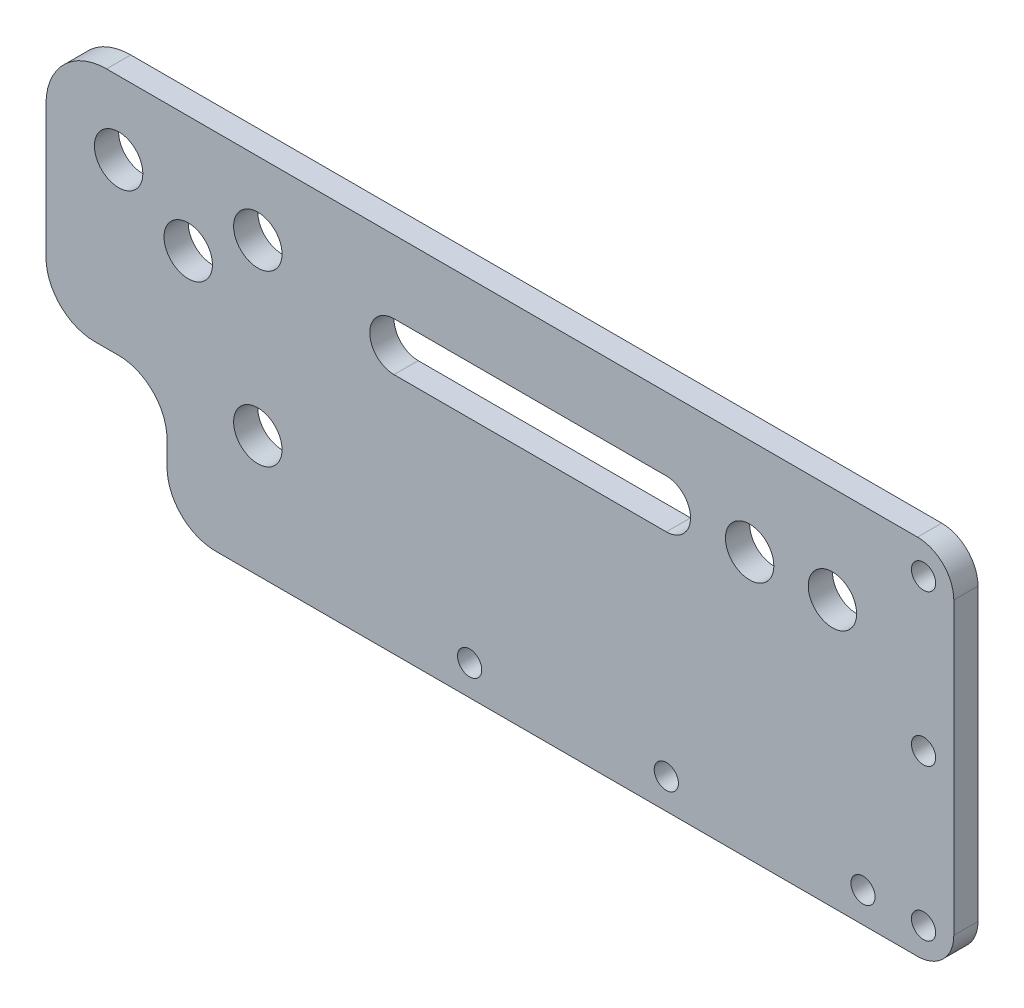
ISO-10303-21;
HEADER;
FILE_DESCRIPTION(('STEP AP214'),'2;1');
FILE_NAME('part.step','',(''),(''),'','','');
FILE_SCHEMA(('AUTOMOTIVE_DESIGN { 1 0 10303 214 1 1 1 1 }'));
ENDSEC;
DATA;
#1=APPLICATION_CONTEXT('core data for automotive mechanical design processes');
#2=APPLICATION_PROTOCOL_DEFINITION('international standard','automotive_design',2000,#1);
#3=PRODUCT_CONTEXT('',#1,'mechanical');
#4=PRODUCT('Part','Part','',(#3));
#5=PRODUCT_RELATED_PRODUCT_CATEGORY('part','',(#4));
#6=PRODUCT_DEFINITION_FORMATION('','',#4);
#7=PRODUCT_DEFINITION_CONTEXT('part definition',#1,'design');
#8=PRODUCT_DEFINITION('design','',#6,#7);
#9=PRODUCT_DEFINITION_SHAPE('','',#8);
#10=(LENGTH_UNIT() NAMED_UNIT(*) SI_UNIT(.MILLI.,.METRE.));
#11=(NAMED_UNIT(*) PLANE_ANGLE_UNIT() SI_UNIT($,.RADIAN.));
#12=(NAMED_UNIT(*) SI_UNIT($,.STERADIAN.) SOLID_ANGLE_UNIT());
#13=UNCERTAINTY_MEASURE_WITH_UNIT(LENGTH_MEASURE(1.E-05),#10,'distance_accuracy_value','');
#14=(GEOMETRIC_REPRESENTATION_CONTEXT(3) GLOBAL_UNCERTAINTY_ASSIGNED_CONTEXT((#13)) GLOBAL_UNIT_ASSIGNED_CONTEXT((#10,
#11,#12)) REPRESENTATION_CONTEXT('',''));
#15=CARTESIAN_POINT('',(0.,0.,0.));
#16=DIRECTION('',(0.,0.,1.));
#17=DIRECTION('',(1.,0.,0.));
#18=AXIS2_PLACEMENT_3D('',#15,#16,#17);
#19=CARTESIAN_POINT('',(28.,8.,4.));
#20=DIRECTION('',(0.,0.,1.));
#21=DIRECTION('',(1.,0.,0.));
#22=AXIS2_PLACEMENT_3D('',#19,#20,#21);
#23=PLANE('',#22);
#24=CARTESIAN_POINT('',(70.,4.99999999999955,4.));
#25=DIRECTION('',(0.,0.,1.));
#26=DIRECTION('',(1.,0.,0.));
#27=AXIS2_PLACEMENT_3D('',#24,#25,#26);
#28=CIRCLE('',#27,2.);
#29=CARTESIAN_POINT('',(72.,4.99999999999955,4.));
#30=VERTEX_POINT('',#29);
#31=EDGE_CURVE('E628',#30,#30,#28,.T.);
#32=ORIENTED_EDGE('',*,*,#31,.F.);
#33=EDGE_LOOP('',(#32));
#34=FACE_BOUND('',#33,.T.);
#35=CARTESIAN_POINT('',(35.,48.,4.));
#36=DIRECTION('',(0.,0.,1.));
#37=DIRECTION('',(1.,0.,0.));
#38=AXIS2_PLACEMENT_3D('',#35,#36,#37);
#39=CIRCLE('',#38,4.00000000000001);
#40=CARTESIAN_POINT('',(39.,48.,4.));
#41=VERTEX_POINT('',#40);
#42=EDGE_CURVE('E640',#41,#41,#39,.T.);
#43=ORIENTED_EDGE('',*,*,#42,.F.);
#44=EDGE_LOOP('',(#43));
#45=FACE_BOUND('',#44,.T.);
#46=CARTESIAN_POINT('',(23.5,40.7198747759699,4.));
#47=DIRECTION('',(0.,0.,1.));
#48=DIRECTION('',(1.,0.,0.));
#49=AXIS2_PLACEMENT_3D('',#46,#47,#48);
#50=CIRCLE('',#49,4.00000000000001);
#51=CARTESIAN_POINT('',(27.5,40.7198747759699,4.));
#52=VERTEX_POINT('',#51);
#53=EDGE_CURVE('E652',#52,#52,#50,.T.);
#54=ORIENTED_EDGE('',*,*,#53,.F.);
#55=EDGE_LOOP('',(#54));
#56=FACE_BOUND('',#55,.T.);
#57=CARTESIAN_POINT('',(135.,5.,4.));
#58=DIRECTION('',(0.,0.,1.));
#59=DIRECTION('',(1.,0.,0.));
#60=AXIS2_PLACEMENT_3D('',#57,#58,#59);
#61=CIRCLE('',#60,2.);
#62=CARTESIAN_POINT('',(137.,5.,4.));
#63=VERTEX_POINT('',#62);
#64=EDGE_CURVE('E664',#63,#63,#61,.T.);
#65=ORIENTED_EDGE('',*,*,#64,.F.);
#66=EDGE_LOOP('',(#65));
#67=FACE_BOUND('',#66,.T.);
#68=CARTESIAN_POINT('',(116.264838239395,44.,4.));
#69=DIRECTION('',(0.,0.,1.));
#70=DIRECTION('',(1.,0.,0.));
#71=AXIS2_PLACEMENT_3D('',#68,#69,#70);
#72=CIRCLE('',#71,4.00000000000001);
#73=CARTESIAN_POINT('',(120.264838239395,44.,4.));
#74=VERTEX_POINT('',#73);
#75=EDGE_CURVE('E178',#74,#74,#72,.T.);
#76=ORIENTED_EDGE('',*,*,#75,.F.);
#77=EDGE_LOOP('',(#76));
#78=FACE_BOUND('',#77,.T.);
#79=CARTESIAN_POINT('',(145.,54.8985603050149,4.));
#80=DIRECTION('',(0.,0.,1.));
#81=DIRECTION('',(1.,0.,0.));
#82=AXIS2_PLACEMENT_3D('',#79,#80,#81);
#83=CIRCLE('',#82,2.);
#84=CARTESIAN_POINT('',(147.,54.8985603050149,4.));
#85=VERTEX_POINT('',#84);
#86=EDGE_CURVE('E194',#85,#85,#83,.T.);
#87=ORIENTED_EDGE('',*,*,#86,.F.);
#88=EDGE_LOOP('',(#87));
#89=FACE_BOUND('',#88,.T.);
#90=CARTESIAN_POINT('',(28.,8.,4.));
#91=DIRECTION('',(0.,0.,1.));
#92=DIRECTION('',(1.,0.,0.));
#93=AXIS2_PLACEMENT_3D('',#90,#91,#92);
#94=CIRCLE('',#93,8.);
#95=CARTESIAN_POINT('',(20.,8.00000000000006,4.));
#96=VERTEX_POINT('',#95);
#97=CARTESIAN_POINT('',(28.0000000000001,0.,4.));
#98=VERTEX_POINT('',#97);
#99=EDGE_CURVE('E200',#96,#98,#94,.T.);
#100=ORIENTED_EDGE('',*,*,#99,.T.);
#101=DIRECTION('',(1.,0.,0.));
#102=VECTOR('',#101,1.);
#103=CARTESIAN_POINT('',(28.0000000000001,0.,4.));
#104=LINE('',#103,#102);
#105=CARTESIAN_POINT('',(144.,0.,4.));
#106=VERTEX_POINT('',#105);
#107=EDGE_CURVE('E203',#98,#106,#104,.T.);
#108=ORIENTED_EDGE('',*,*,#107,.T.);
#109=CARTESIAN_POINT('',(144.,6.,4.));
#110=DIRECTION('',(0.,0.,1.));
#111=DIRECTION('',(1.,0.,0.));
#112=AXIS2_PLACEMENT_3D('',#109,#110,#111);
#113=CIRCLE('',#112,6.);
#114=CARTESIAN_POINT('',(150.,6.00000000000004,4.));
#115=VERTEX_POINT('',#114);
#116=EDGE_CURVE('E206',#106,#115,#113,.T.);
#117=ORIENTED_EDGE('',*,*,#116,.T.);
#118=DIRECTION('',(0.,1.,0.));
#119=VECTOR('',#118,1.);
#120=CARTESIAN_POINT('',(150.,54.,4.));
#121=LINE('',#120,#119);
#122=CARTESIAN_POINT('',(150.,54.,4.));
#123=VERTEX_POINT('',#122);
#124=EDGE_CURVE('E208',#115,#123,#121,.T.);
#125=ORIENTED_EDGE('',*,*,#124,.T.);
#126=CARTESIAN_POINT('',(144.,54.,4.));
#127=DIRECTION('',(0.,0.,1.));
#128=DIRECTION('',(-1.,0.,0.));
#129=AXIS2_PLACEMENT_3D('',#126,#127,#128);
#130=CIRCLE('',#129,6.);
#131=CARTESIAN_POINT('',(144.,60.,4.));
#132=VERTEX_POINT('',#131);
#133=EDGE_CURVE('E210',#123,#132,#130,.T.);
#134=ORIENTED_EDGE('',*,*,#133,.T.);
#135=DIRECTION('',(-1.,0.,0.));
#136=VECTOR('',#135,1.);
#137=CARTESIAN_POINT('',(140.,60.,4.));
#138=LINE('',#137,#136);
#139=CARTESIAN_POINT('',(10.0000000000001,60.,4.));
#140=VERTEX_POINT('',#139);
#141=EDGE_CURVE('E212',#132,#140,#138,.T.);
#142=ORIENTED_EDGE('',*,*,#141,.T.);
#143=CARTESIAN_POINT('',(10.,50.,4.));
#144=DIRECTION('',(0.,0.,1.));
#145=DIRECTION('',(-1.,0.,0.));
#146=AXIS2_PLACEMENT_3D('',#143,#144,#145);
#147=CIRCLE('',#146,10.);
#148=CARTESIAN_POINT('',(0.,49.9999999999999,4.));
#149=VERTEX_POINT('',#148);
#150=EDGE_CURVE('E214',#140,#149,#147,.T.);
#151=ORIENTED_EDGE('',*,*,#150,.T.);
#152=DIRECTION('',(0.,-1.,0.));
#153=VECTOR('',#152,1.);
#154=CARTESIAN_POINT('',(0.,28.0000000000001,4.));
#155=LINE('',#154,#153);
#156=CARTESIAN_POINT('',(0.,28.,4.));
#157=VERTEX_POINT('',#156);
#158=EDGE_CURVE('E216',#149,#157,#155,.T.);
#159=ORIENTED_EDGE('',*,*,#158,.T.);
#160=CARTESIAN_POINT('',(8.,28.,4.));
#161=DIRECTION('',(0.,0.,1.));
#162=DIRECTION('',(-1.,0.,0.));
#163=AXIS2_PLACEMENT_3D('',#160,#161,#162);
#164=CIRCLE('',#163,8.);
#165=CARTESIAN_POINT('',(8.00000000000005,20.,4.));
#166=VERTEX_POINT('',#165);
#167=EDGE_CURVE('E218',#157,#166,#164,.T.);
#168=ORIENTED_EDGE('',*,*,#167,.T.);
#169=DIRECTION('',(1.,0.,0.));
#170=VECTOR('',#169,1.);
#171=CARTESIAN_POINT('',(8.00000000000005,20.,4.));
#172=LINE('',#171,#170);
#173=CARTESIAN_POINT('',(11.9999999999999,20.,4.));
#174=VERTEX_POINT('',#173);
#175=EDGE_CURVE('E220',#166,#174,#172,.T.);
#176=ORIENTED_EDGE('',*,*,#175,.T.);
#177=CARTESIAN_POINT('',(12.,12.,4.));
#178=DIRECTION('',(0.,0.,-1.));
#179=DIRECTION('',(-1.,0.,0.));
#180=AXIS2_PLACEMENT_3D('',#177,#178,#179);
#181=CIRCLE('',#180,8.);
#182=CARTESIAN_POINT('',(20.,11.9999999999999,4.));
#183=VERTEX_POINT('',#182);
#184=EDGE_CURVE('E222',#174,#183,#181,.T.);
#185=ORIENTED_EDGE('',*,*,#184,.T.);
#186=DIRECTION('',(0.,-1.,0.));
#187=VECTOR('',#186,1.);
#188=CARTESIAN_POINT('',(20.,11.9999999999999,4.));
#189=LINE('',#188,#187);
#190=EDGE_CURVE('E224',#183,#96,#189,.T.);
#191=ORIENTED_EDGE('',*,*,#190,.T.);
#192=EDGE_LOOP('',(#100,#108,#117,#125,#134,#142,#151,#159,#168,#176,#185,#191));
#193=FACE_BOUND('',#192,.T.);
#194=CARTESIAN_POINT('',(35.,20.,4.));
#195=DIRECTION('',(0.,0.,1.));
#196=DIRECTION('',(1.,0.,0.));
#197=AXIS2_PLACEMENT_3D('',#194,#195,#196);
#198=CIRCLE('',#197,4.00000000000001);
#199=CARTESIAN_POINT('',(39.,20.,4.));
#200=VERTEX_POINT('',#199);
#201=EDGE_CURVE('E188',#200,#200,#198,.T.);
#202=ORIENTED_EDGE('',*,*,#201,.F.);
#203=EDGE_LOOP('',(#202));
#204=FACE_BOUND('',#203,.T.);
#205=DIRECTION('',(1.,0.,0.));
#206=VECTOR('',#205,1.);
#207=CARTESIAN_POINT('',(57.5,40.,4.));
#208=LINE('',#207,#206);
#209=CARTESIAN_POINT('',(57.5,40.,4.));
#210=VERTEX_POINT('',#209);
#211=CARTESIAN_POINT('',(102.5,40.,4.));
#212=VERTEX_POINT('',#211);
#213=EDGE_CURVE('E157',#210,#212,#208,.T.);
#214=ORIENTED_EDGE('',*,*,#213,.F.);
#215=CARTESIAN_POINT('',(57.5,44.,4.));
#216=DIRECTION('',(0.,0.,1.));
#217=DIRECTION('',(1.,0.,0.));
#218=AXIS2_PLACEMENT_3D('',#215,#216,#217);
#219=CIRCLE('',#218,4.);
#220=CARTESIAN_POINT('',(57.5,48.,4.));
#221=VERTEX_POINT('',#220);
#222=EDGE_CURVE('E149',#221,#210,#219,.T.);
#223=ORIENTED_EDGE('',*,*,#222,.F.);
#224=DIRECTION('',(-1.,0.,0.));
#225=VECTOR('',#224,1.);
#226=CARTESIAN_POINT('',(57.5,48.,4.));
#227=LINE('',#226,#225);
#228=CARTESIAN_POINT('',(102.5,48.,4.));
#229=VERTEX_POINT('',#228);
#230=EDGE_CURVE('E172',#229,#221,#227,.T.);
#231=ORIENTED_EDGE('',*,*,#230,.F.);
#232=CARTESIAN_POINT('',(102.5,44.,4.));
#233=DIRECTION('',(0.,0.,1.));
#234=DIRECTION('',(1.,0.,0.));
#235=AXIS2_PLACEMENT_3D('',#232,#233,#234);
#236=CIRCLE('',#235,4.);
#237=EDGE_CURVE('E170',#212,#229,#236,.T.);
#238=ORIENTED_EDGE('',*,*,#237,.F.);
#239=EDGE_LOOP('',(#214,#223,#231,#238));
#240=FACE_BOUND('',#239,.T.);
#241=CARTESIAN_POINT('',(129.947688146771,44.,4.));
#242=DIRECTION('',(0.,0.,1.));
#243=DIRECTION('',(1.,0.,0.));
#244=AXIS2_PLACEMENT_3D('',#241,#242,#243);
#245=CIRCLE('',#244,3.99999999999999);
#246=CARTESIAN_POINT('',(133.947688146771,44.,4.));
#247=VERTEX_POINT('',#246);
#248=EDGE_CURVE('E670',#247,#247,#245,.T.);
#249=ORIENTED_EDGE('',*,*,#248,.F.);
#250=EDGE_LOOP('',(#249));
#251=FACE_BOUND('',#250,.T.);
#252=CARTESIAN_POINT('',(11.9999999999999,48.,4.));
#253=DIRECTION('',(0.,0.,1.));
#254=DIRECTION('',(1.,0.,0.));
#255=AXIS2_PLACEMENT_3D('',#252,#253,#254);
#256=CIRCLE('',#255,4.00000000000001);
#257=CARTESIAN_POINT('',(16.,48.,4.));
#258=VERTEX_POINT('',#257);
#259=EDGE_CURVE('E658',#258,#258,#256,.T.);
#260=ORIENTED_EDGE('',*,*,#259,.F.);
#261=EDGE_LOOP('',(#260));
#262=FACE_BOUND('',#261,.T.);
#263=CARTESIAN_POINT('',(145.,29.8985603050149,4.));
#264=DIRECTION('',(0.,0.,1.));
#265=DIRECTION('',(1.,0.,0.));
#266=AXIS2_PLACEMENT_3D('',#263,#264,#265);
#267=CIRCLE('',#266,2.);
#268=CARTESIAN_POINT('',(147.,29.8985603050149,4.));
#269=VERTEX_POINT('',#268);
#270=EDGE_CURVE('E646',#269,#269,#267,.T.);
#271=ORIENTED_EDGE('',*,*,#270,.F.);
#272=EDGE_LOOP('',(#271));
#273=FACE_BOUND('',#272,.T.);
#274=CARTESIAN_POINT('',(102.5,4.99999999999977,4.));
#275=DIRECTION('',(0.,0.,1.));
#276=DIRECTION('',(1.,0.,0.));
#277=AXIS2_PLACEMENT_3D('',#274,#275,#276);
#278=CIRCLE('',#277,2.);
#279=CARTESIAN_POINT('',(104.5,4.99999999999977,4.));
#280=VERTEX_POINT('',#279);
#281=EDGE_CURVE('E634',#280,#280,#278,.T.);
#282=ORIENTED_EDGE('',*,*,#281,.F.);
#283=EDGE_LOOP('',(#282));
#284=FACE_BOUND('',#283,.T.);
#285=CARTESIAN_POINT('',(145.000000000001,4.89856030501486,4.));
#286=DIRECTION('',(0.,0.,1.));
#287=DIRECTION('',(1.,0.,0.));
#288=AXIS2_PLACEMENT_3D('',#285,#286,#287);
#289=CIRCLE('',#288,2.);
#290=CARTESIAN_POINT('',(147.000000000001,4.89856030501486,4.));
#291=VERTEX_POINT('',#290);
#292=EDGE_CURVE('E619',#291,#291,#289,.T.);
#293=ORIENTED_EDGE('',*,*,#292,.F.);
#294=EDGE_LOOP('',(#293));
#295=FACE_BOUND('',#294,.T.);
#296=ADVANCED_FACE('F36',(#34,#45,#56,#67,#78,#89,#193,#204,#240,#251,#262,#273,#284,#295),#23,.T.);
#297=CARTESIAN_POINT('',(28.,8.,0.));
#298=DIRECTION('',(0.,0.,1.));
#299=DIRECTION('',(1.,0.,0.));
#300=AXIS2_PLACEMENT_3D('',#297,#298,#299);
#301=PLANE('',#300);
#302=CARTESIAN_POINT('',(35.,20.,0.));
#303=DIRECTION('',(0.,0.,1.));
#304=DIRECTION('',(1.,0.,0.));
#305=AXIS2_PLACEMENT_3D('',#302,#303,#304);
#306=CIRCLE('',#305,4.00000000000001);
#307=CARTESIAN_POINT('',(39.,20.,0.));
#308=VERTEX_POINT('',#307);
#309=EDGE_CURVE('E165',#308,#308,#306,.T.);
#310=ORIENTED_EDGE('',*,*,#309,.T.);
#311=EDGE_LOOP('',(#310));
#312=FACE_BOUND('',#311,.T.);
#313=CARTESIAN_POINT('',(145.,54.8985603050149,0.));
#314=DIRECTION('',(0.,0.,1.));
#315=DIRECTION('',(1.,0.,0.));
#316=AXIS2_PLACEMENT_3D('',#313,#314,#315);
#317=CIRCLE('',#316,2.);
#318=CARTESIAN_POINT('',(147.,54.8985603050149,0.));
#319=VERTEX_POINT('',#318);
#320=EDGE_CURVE('E191',#319,#319,#317,.T.);
#321=ORIENTED_EDGE('',*,*,#320,.T.);
#322=EDGE_LOOP('',(#321));
#323=FACE_BOUND('',#322,.T.);
#324=CARTESIAN_POINT('',(28.,8.,0.));
#325=DIRECTION('',(0.,0.,1.));
#326=DIRECTION('',(1.,0.,0.));
#327=AXIS2_PLACEMENT_3D('',#324,#325,#326);
#328=CIRCLE('',#327,8.);
#329=CARTESIAN_POINT('',(20.,8.00000000000006,0.));
#330=VERTEX_POINT('',#329);
#331=CARTESIAN_POINT('',(28.0000000000001,0.,0.));
#332=VERTEX_POINT('',#331);
#333=EDGE_CURVE('E197',#330,#332,#328,.T.);
#334=ORIENTED_EDGE('',*,*,#333,.F.);
#335=DIRECTION('',(0.,-1.,0.));
#336=VECTOR('',#335,1.);
#337=CARTESIAN_POINT('',(20.,11.9999999999999,0.));
#338=LINE('',#337,#336);
#339=CARTESIAN_POINT('',(20.,11.9999999999999,0.));
#340=VERTEX_POINT('',#339);
#341=EDGE_CURVE('E204',#340,#330,#338,.T.);
#342=ORIENTED_EDGE('',*,*,#341,.F.);
#343=CARTESIAN_POINT('',(12.,12.,0.));
#344=DIRECTION('',(0.,0.,-1.));
#345=DIRECTION('',(-1.,0.,0.));
#346=AXIS2_PLACEMENT_3D('',#343,#344,#345);
#347=CIRCLE('',#346,8.);
#348=CARTESIAN_POINT('',(11.9999999999999,20.,0.));
#349=VERTEX_POINT('',#348);
#350=EDGE_CURVE('E248',#349,#340,#347,.T.);
#351=ORIENTED_EDGE('',*,*,#350,.F.);
#352=DIRECTION('',(1.,0.,0.));
#353=VECTOR('',#352,1.);
#354=CARTESIAN_POINT('',(8.00000000000005,20.,0.));
#355=LINE('',#354,#353);
#356=CARTESIAN_POINT('',(8.00000000000005,20.,0.));
#357=VERTEX_POINT('',#356);
#358=EDGE_CURVE('E246',#357,#349,#355,.T.);
#359=ORIENTED_EDGE('',*,*,#358,.F.);
#360=CARTESIAN_POINT('',(8.,28.,0.));
#361=DIRECTION('',(0.,0.,1.));
#362=DIRECTION('',(-1.,0.,0.));
#363=AXIS2_PLACEMENT_3D('',#360,#361,#362);
#364=CIRCLE('',#363,8.);
#365=CARTESIAN_POINT('',(0.,28.,0.));
#366=VERTEX_POINT('',#365);
#367=EDGE_CURVE('E244',#366,#357,#364,.T.);
#368=ORIENTED_EDGE('',*,*,#367,.F.);
#369=DIRECTION('',(0.,-1.,0.));
#370=VECTOR('',#369,1.);
#371=CARTESIAN_POINT('',(0.,28.0000000000001,0.));
#372=LINE('',#371,#370);
#373=CARTESIAN_POINT('',(0.,49.9999999999999,0.));
#374=VERTEX_POINT('',#373);
#375=EDGE_CURVE('E242',#374,#366,#372,.T.);
#376=ORIENTED_EDGE('',*,*,#375,.F.);
#377=CARTESIAN_POINT('',(10.,50.,0.));
#378=DIRECTION('',(0.,0.,1.));
#379=DIRECTION('',(-1.,0.,0.));
#380=AXIS2_PLACEMENT_3D('',#377,#378,#379);
#381=CIRCLE('',#380,10.);
#382=CARTESIAN_POINT('',(10.0000000000001,60.,0.));
#383=VERTEX_POINT('',#382);
#384=EDGE_CURVE('E240',#383,#374,#381,.T.);
#385=ORIENTED_EDGE('',*,*,#384,.F.);
#386=DIRECTION('',(-1.,0.,0.));
#387=VECTOR('',#386,1.);
#388=CARTESIAN_POINT('',(10.0000000000001,60.,0.));
#389=LINE('',#388,#387);
#390=CARTESIAN_POINT('',(144.,60.,0.));
#391=VERTEX_POINT('',#390);
#392=EDGE_CURVE('E238',#391,#383,#389,.T.);
#393=ORIENTED_EDGE('',*,*,#392,.F.);
#394=CARTESIAN_POINT('',(144.,54.,0.));
#395=DIRECTION('',(0.,0.,1.));
#396=DIRECTION('',(-1.,0.,0.));
#397=AXIS2_PLACEMENT_3D('',#394,#395,#396);
#398=CIRCLE('',#397,6.);
#399=CARTESIAN_POINT('',(150.,54.,0.));
#400=VERTEX_POINT('',#399);
#401=EDGE_CURVE('E235',#400,#391,#398,.T.);
#402=ORIENTED_EDGE('',*,*,#401,.F.);
#403=DIRECTION('',(0.,1.,0.));
#404=VECTOR('',#403,1.);
#405=CARTESIAN_POINT('',(150.,54.,0.));
#406=LINE('',#405,#404);
#407=CARTESIAN_POINT('',(150.,6.00000000000004,0.));
#408=VERTEX_POINT('',#407);
#409=EDGE_CURVE('E233',#408,#400,#406,.T.);
#410=ORIENTED_EDGE('',*,*,#409,.F.);
#411=CARTESIAN_POINT('',(144.,6.,0.));
#412=DIRECTION('',(0.,0.,1.));
#413=DIRECTION('',(1.,0.,0.));
#414=AXIS2_PLACEMENT_3D('',#411,#412,#413);
#415=CIRCLE('',#414,6.);
#416=CARTESIAN_POINT('',(144.,0.,0.));
#417=VERTEX_POINT('',#416);
#418=EDGE_CURVE('E231',#417,#408,#415,.T.);
#419=ORIENTED_EDGE('',*,*,#418,.F.);
#420=DIRECTION('',(1.,0.,0.));
#421=VECTOR('',#420,1.);
#422=CARTESIAN_POINT('',(140.,0.,0.));
#423=LINE('',#422,#421);
#424=EDGE_CURVE('E229',#332,#417,#423,.T.);
#425=ORIENTED_EDGE('',*,*,#424,.F.);
#426=EDGE_LOOP('',(#334,#342,#351,#359,#368,#376,#385,#393,#402,#410,#419,#425));
#427=FACE_BOUND('',#426,.T.);
#428=CARTESIAN_POINT('',(57.5,44.,0.));
#429=DIRECTION('',(0.,0.,1.));
#430=DIRECTION('',(1.,0.,0.));
#431=AXIS2_PLACEMENT_3D('',#428,#429,#430);
#432=CIRCLE('',#431,4.);
#433=CARTESIAN_POINT('',(57.5,48.,0.));
#434=VERTEX_POINT('',#433);
#435=CARTESIAN_POINT('',(57.5,40.,0.));
#436=VERTEX_POINT('',#435);
#437=EDGE_CURVE('E59',#434,#436,#432,.T.);
#438=ORIENTED_EDGE('',*,*,#437,.T.);
#439=DIRECTION('',(1.,0.,0.));
#440=VECTOR('',#439,1.);
#441=CARTESIAN_POINT('',(57.5,40.,0.));
#442=LINE('',#441,#440);
#443=CARTESIAN_POINT('',(102.5,40.,0.));
#444=VERTEX_POINT('',#443);
#445=EDGE_CURVE('E164',#436,#444,#442,.T.);
#446=ORIENTED_EDGE('',*,*,#445,.T.);
#447=CARTESIAN_POINT('',(102.5,44.,0.));
#448=DIRECTION('',(0.,0.,1.));
#449=DIRECTION('',(1.,0.,0.));
#450=AXIS2_PLACEMENT_3D('',#447,#448,#449);
#451=CIRCLE('',#450,4.);
#452=CARTESIAN_POINT('',(102.5,48.,0.));
#453=VERTEX_POINT('',#452);
#454=EDGE_CURVE('E180',#444,#453,#451,.T.);
#455=ORIENTED_EDGE('',*,*,#454,.T.);
#456=DIRECTION('',(-1.,0.,0.));
#457=VECTOR('',#456,1.);
#458=CARTESIAN_POINT('',(57.5,48.,0.));
#459=LINE('',#458,#457);
#460=EDGE_CURVE('E158',#453,#434,#459,.T.);
#461=ORIENTED_EDGE('',*,*,#460,.T.);
#462=EDGE_LOOP('',(#438,#446,#455,#461));
#463=FACE_BOUND('',#462,.T.);
#464=CARTESIAN_POINT('',(116.264838239395,44.,0.));
#465=DIRECTION('',(0.,0.,1.));
#466=DIRECTION('',(1.,0.,0.));
#467=AXIS2_PLACEMENT_3D('',#464,#465,#466);
#468=CIRCLE('',#467,4.00000000000001);
#469=CARTESIAN_POINT('',(120.264838239395,44.,0.));
#470=VERTEX_POINT('',#469);
#471=EDGE_CURVE('E673',#470,#470,#468,.T.);
#472=ORIENTED_EDGE('',*,*,#471,.T.);
#473=EDGE_LOOP('',(#472));
#474=FACE_BOUND('',#473,.T.);
#475=CARTESIAN_POINT('',(129.947688146771,44.,0.));
#476=DIRECTION('',(0.,0.,1.));
#477=DIRECTION('',(1.,0.,0.));
#478=AXIS2_PLACEMENT_3D('',#475,#476,#477);
#479=CIRCLE('',#478,3.99999999999999);
#480=CARTESIAN_POINT('',(133.947688146771,44.,0.));
#481=VERTEX_POINT('',#480);
#482=EDGE_CURVE('E667',#481,#481,#479,.T.);
#483=ORIENTED_EDGE('',*,*,#482,.T.);
#484=EDGE_LOOP('',(#483));
#485=FACE_BOUND('',#484,.T.);
#486=CARTESIAN_POINT('',(135.,5.,0.));
#487=DIRECTION('',(0.,0.,1.));
#488=DIRECTION('',(1.,0.,0.));
#489=AXIS2_PLACEMENT_3D('',#486,#487,#488);
#490=CIRCLE('',#489,2.);
#491=CARTESIAN_POINT('',(137.,5.,0.));
#492=VERTEX_POINT('',#491);
#493=EDGE_CURVE('E661',#492,#492,#490,.T.);
#494=ORIENTED_EDGE('',*,*,#493,.T.);
#495=EDGE_LOOP('',(#494));
#496=FACE_BOUND('',#495,.T.);
#497=CARTESIAN_POINT('',(11.9999999999999,48.,0.));
#498=DIRECTION('',(0.,0.,1.));
#499=DIRECTION('',(1.,0.,0.));
#500=AXIS2_PLACEMENT_3D('',#497,#498,#499);
#501=CIRCLE('',#500,4.00000000000001);
#502=CARTESIAN_POINT('',(16.,48.,0.));
#503=VERTEX_POINT('',#502);
#504=EDGE_CURVE('E655',#503,#503,#501,.T.);
#505=ORIENTED_EDGE('',*,*,#504,.T.);
#506=EDGE_LOOP('',(#505));
#507=FACE_BOUND('',#506,.T.);
#508=CARTESIAN_POINT('',(23.5,40.7198747759699,0.));
#509=DIRECTION('',(0.,0.,1.));
#510=DIRECTION('',(1.,0.,0.));
#511=AXIS2_PLACEMENT_3D('',#508,#509,#510);
#512=CIRCLE('',#511,4.00000000000001);
#513=CARTESIAN_POINT('',(27.5,40.7198747759699,0.));
#514=VERTEX_POINT('',#513);
#515=EDGE_CURVE('E649',#514,#514,#512,.T.);
#516=ORIENTED_EDGE('',*,*,#515,.T.);
#517=EDGE_LOOP('',(#516));
#518=FACE_BOUND('',#517,.T.);
#519=CARTESIAN_POINT('',(145.,29.8985603050149,0.));
#520=DIRECTION('',(0.,0.,1.));
#521=DIRECTION('',(1.,0.,0.));
#522=AXIS2_PLACEMENT_3D('',#519,#520,#521);
#523=CIRCLE('',#522,2.);
#524=CARTESIAN_POINT('',(147.,29.8985603050149,0.));
#525=VERTEX_POINT('',#524);
#526=EDGE_CURVE('E643',#525,#525,#523,.T.);
#527=ORIENTED_EDGE('',*,*,#526,.T.);
#528=EDGE_LOOP('',(#527));
#529=FACE_BOUND('',#528,.T.);
#530=CARTESIAN_POINT('',(35.,48.,0.));
#531=DIRECTION('',(0.,0.,1.));
#532=DIRECTION('',(1.,0.,0.));
#533=AXIS2_PLACEMENT_3D('',#530,#531,#532);
#534=CIRCLE('',#533,4.00000000000001);
#535=CARTESIAN_POINT('',(39.,48.,0.));
#536=VERTEX_POINT('',#535);
#537=EDGE_CURVE('E637',#536,#536,#534,.T.);
#538=ORIENTED_EDGE('',*,*,#537,.T.);
#539=EDGE_LOOP('',(#538));
#540=FACE_BOUND('',#539,.T.);
#541=CARTESIAN_POINT('',(102.5,4.99999999999977,0.));
#542=DIRECTION('',(0.,0.,1.));
#543=DIRECTION('',(1.,0.,0.));
#544=AXIS2_PLACEMENT_3D('',#541,#542,#543);
#545=CIRCLE('',#544,2.);
#546=CARTESIAN_POINT('',(104.5,4.99999999999977,0.));
#547=VERTEX_POINT('',#546);
#548=EDGE_CURVE('E631',#547,#547,#545,.T.);
#549=ORIENTED_EDGE('',*,*,#548,.T.);
#550=EDGE_LOOP('',(#549));
#551=FACE_BOUND('',#550,.T.);
#552=CARTESIAN_POINT('',(70.,4.99999999999955,0.));
#553=DIRECTION('',(0.,0.,1.));
#554=DIRECTION('',(1.,0.,0.));
#555=AXIS2_PLACEMENT_3D('',#552,#553,#554);
#556=CIRCLE('',#555,2.);
#557=CARTESIAN_POINT('',(72.,4.99999999999955,0.));
#558=VERTEX_POINT('',#557);
#559=EDGE_CURVE('E625',#558,#558,#556,.T.);
#560=ORIENTED_EDGE('',*,*,#559,.T.);
#561=EDGE_LOOP('',(#560));
#562=FACE_BOUND('',#561,.T.);
#563=CARTESIAN_POINT('',(145.000000000001,4.89856030501486,0.));
#564=DIRECTION('',(0.,0.,1.));
#565=DIRECTION('',(1.,0.,0.));
#566=AXIS2_PLACEMENT_3D('',#563,#564,#565);
#567=CIRCLE('',#566,2.);
#568=CARTESIAN_POINT('',(147.000000000001,4.89856030501486,0.));
#569=VERTEX_POINT('',#568);
#570=EDGE_CURVE('E622',#569,#569,#567,.T.);
#571=ORIENTED_EDGE('',*,*,#570,.T.);
#572=EDGE_LOOP('',(#571));
#573=FACE_BOUND('',#572,.T.);
#574=ADVANCED_FACE('F290',(#312,#323,#427,#463,#474,#485,#496,#507,#518,#529,#540,#551,#562,
#573),#301,.F.);
#575=CARTESIAN_POINT('',(28.,8.,4.));
#576=DIRECTION('',(0.,0.,-1.));
#577=DIRECTION('',(-1.,0.,0.));
#578=AXIS2_PLACEMENT_3D('',#575,#576,#577);
#579=CYLINDRICAL_SURFACE('',#578,8.);
#580=ORIENTED_EDGE('',*,*,#333,.T.);
#581=DIRECTION('',(0.,0.,-1.));
#582=VECTOR('',#581,1.);
#583=CARTESIAN_POINT('',(28.0000000000001,0.,4.));
#584=LINE('',#583,#582);
#585=EDGE_CURVE('E11',#98,#332,#584,.T.);
#586=ORIENTED_EDGE('',*,*,#585,.F.);
#587=ORIENTED_EDGE('',*,*,#99,.F.);
#588=DIRECTION('',(0.,0.,-1.));
#589=VECTOR('',#588,1.);
#590=CARTESIAN_POINT('',(20.,8.00000000000006,4.));
#591=LINE('',#590,#589);
#592=EDGE_CURVE('E226',#96,#330,#591,.T.);
#593=ORIENTED_EDGE('',*,*,#592,.T.);
#594=EDGE_LOOP('',(#580,#586,#587,#593));
#595=FACE_BOUND('',#594,.T.);
#596=ADVANCED_FACE('F38',(#595),#579,.T.);
#597=CARTESIAN_POINT('',(140.,0.,4.));
#598=DIRECTION('',(0.,1.,0.));
#599=DIRECTION('',(0.,0.,1.));
#600=AXIS2_PLACEMENT_3D('',#597,#598,#599);
#601=PLANE('',#600);
#602=ORIENTED_EDGE('',*,*,#424,.T.);
#603=DIRECTION('',(0.,0.,-1.));
#604=VECTOR('',#603,1.);
#605=CARTESIAN_POINT('',(144.,0.,4.));
#606=LINE('',#605,#604);
#607=EDGE_CURVE('E44',#106,#417,#606,.T.);
#608=ORIENTED_EDGE('',*,*,#607,.F.);
#609=ORIENTED_EDGE('',*,*,#107,.F.);
#610=ORIENTED_EDGE('',*,*,#585,.T.);
#611=EDGE_LOOP('',(#602,#608,#609,#610));
#612=FACE_BOUND('',#611,.T.);
#613=ADVANCED_FACE('F307',(#612),#601,.F.);
#614=CARTESIAN_POINT('',(144.,6.,4.));
#615=DIRECTION('',(0.,0.,-1.));
#616=DIRECTION('',(-1.,0.,0.));
#617=AXIS2_PLACEMENT_3D('',#614,#615,#616);
#618=CYLINDRICAL_SURFACE('',#617,6.);
#619=ORIENTED_EDGE('',*,*,#418,.T.);
#620=DIRECTION('',(0.,0.,-1.));
#621=VECTOR('',#620,1.);
#622=CARTESIAN_POINT('',(150.,6.00000000000004,4.));
#623=LINE('',#622,#621);
#624=EDGE_CURVE('E277',#115,#408,#623,.T.);
#625=ORIENTED_EDGE('',*,*,#624,.F.);
#626=ORIENTED_EDGE('',*,*,#116,.F.);
#627=ORIENTED_EDGE('',*,*,#607,.T.);
#628=EDGE_LOOP('',(#619,#625,#626,#627));
#629=FACE_BOUND('',#628,.T.);
#630=ADVANCED_FACE('F284',(#629),#618,.T.);
#631=CARTESIAN_POINT('',(150.,54.,4.));
#632=DIRECTION('',(-1.,0.,0.));
#633=DIRECTION('',(0.,0.,1.));
#634=AXIS2_PLACEMENT_3D('',#631,#632,#633);
#635=PLANE('',#634);
#636=ORIENTED_EDGE('',*,*,#409,.T.);
#637=DIRECTION('',(0.,0.,-1.));
#638=VECTOR('',#637,1.);
#639=CARTESIAN_POINT('',(150.,54.,4.));
#640=LINE('',#639,#638);
#641=EDGE_CURVE('E274',#123,#400,#640,.T.);
#642=ORIENTED_EDGE('',*,*,#641,.F.);
#643=ORIENTED_EDGE('',*,*,#124,.F.);
#644=ORIENTED_EDGE('',*,*,#624,.T.);
#645=EDGE_LOOP('',(#636,#642,#643,#644));
#646=FACE_BOUND('',#645,.T.);
#647=ADVANCED_FACE('F295',(#646),#635,.F.);
#648=CARTESIAN_POINT('',(144.,54.,4.));
#649=DIRECTION('',(0.,0.,-1.));
#650=DIRECTION('',(-1.,0.,0.));
#651=AXIS2_PLACEMENT_3D('',#648,#649,#650);
#652=CYLINDRICAL_SURFACE('',#651,6.);
#653=ORIENTED_EDGE('',*,*,#401,.T.);
#654=DIRECTION('',(0.,0.,-1.));
#655=VECTOR('',#654,1.);
#656=CARTESIAN_POINT('',(144.,60.,4.));
#657=LINE('',#656,#655);
#658=EDGE_CURVE('E271',#132,#391,#657,.T.);
#659=ORIENTED_EDGE('',*,*,#658,.F.);
#660=ORIENTED_EDGE('',*,*,#133,.F.);
#661=ORIENTED_EDGE('',*,*,#641,.T.);
#662=EDGE_LOOP('',(#653,#659,#660,#661));
#663=FACE_BOUND('',#662,.T.);
#664=ADVANCED_FACE('F299',(#663),#652,.T.);
#665=CARTESIAN_POINT('',(10.0000000000001,60.,4.));
#666=DIRECTION('',(0.,-1.,0.));
#667=DIRECTION('',(0.,0.,-1.));
#668=AXIS2_PLACEMENT_3D('',#665,#666,#667);
#669=PLANE('',#668);
#670=ORIENTED_EDGE('',*,*,#392,.T.);
#671=DIRECTION('',(0.,0.,-1.));
#672=VECTOR('',#671,1.);
#673=CARTESIAN_POINT('',(10.0000000000001,60.,4.));
#674=LINE('',#673,#672);
#675=EDGE_CURVE('E268',#140,#383,#674,.T.);
#676=ORIENTED_EDGE('',*,*,#675,.F.);
#677=ORIENTED_EDGE('',*,*,#141,.F.);
#678=ORIENTED_EDGE('',*,*,#658,.T.);
#679=EDGE_LOOP('',(#670,#676,#677,#678));
#680=FACE_BOUND('',#679,.T.);
#681=ADVANCED_FACE('F340',(#680),#669,.F.);
#682=CARTESIAN_POINT('',(10.,50.,4.));
#683=DIRECTION('',(0.,0.,-1.));
#684=DIRECTION('',(-1.,0.,0.));
#685=AXIS2_PLACEMENT_3D('',#682,#683,#684);
#686=CYLINDRICAL_SURFACE('',#685,10.);
#687=ORIENTED_EDGE('',*,*,#384,.T.);
#688=DIRECTION('',(0.,0.,-1.));
#689=VECTOR('',#688,1.);
#690=CARTESIAN_POINT('',(0.,49.9999999999999,4.));
#691=LINE('',#690,#689);
#692=EDGE_CURVE('E265',#149,#374,#691,.T.);
#693=ORIENTED_EDGE('',*,*,#692,.F.);
#694=ORIENTED_EDGE('',*,*,#150,.F.);
#695=ORIENTED_EDGE('',*,*,#675,.T.);
#696=EDGE_LOOP('',(#687,#693,#694,#695));
#697=FACE_BOUND('',#696,.T.);
#698=ADVANCED_FACE('F338',(#697),#686,.T.);
#699=CARTESIAN_POINT('',(0.,28.0000000000001,4.));
#700=DIRECTION('',(1.,0.,0.));
#701=DIRECTION('',(0.,1.,0.));
#702=AXIS2_PLACEMENT_3D('',#699,#700,#701);
#703=PLANE('',#702);
#704=ORIENTED_EDGE('',*,*,#375,.T.);
#705=DIRECTION('',(0.,0.,-1.));
#706=VECTOR('',#705,1.);
#707=CARTESIAN_POINT('',(0.,28.,4.));
#708=LINE('',#707,#706);
#709=EDGE_CURVE('E262',#157,#366,#708,.T.);
#710=ORIENTED_EDGE('',*,*,#709,.F.);
#711=ORIENTED_EDGE('',*,*,#158,.F.);
#712=ORIENTED_EDGE('',*,*,#692,.T.);
#713=EDGE_LOOP('',(#704,#710,#711,#712));
#714=FACE_BOUND('',#713,.T.);
#715=ADVANCED_FACE('F334',(#714),#703,.F.);
#716=CARTESIAN_POINT('',(8.,28.,4.));
#717=DIRECTION('',(0.,0.,-1.));
#718=DIRECTION('',(-1.,0.,0.));
#719=AXIS2_PLACEMENT_3D('',#716,#717,#718);
#720=CYLINDRICAL_SURFACE('',#719,8.);
#721=ORIENTED_EDGE('',*,*,#367,.T.);
#722=DIRECTION('',(0.,0.,-1.));
#723=VECTOR('',#722,1.);
#724=CARTESIAN_POINT('',(8.00000000000005,20.,4.));
#725=LINE('',#724,#723);
#726=EDGE_CURVE('E259',#166,#357,#725,.T.);
#727=ORIENTED_EDGE('',*,*,#726,.F.);
#728=ORIENTED_EDGE('',*,*,#167,.F.);
#729=ORIENTED_EDGE('',*,*,#709,.T.);
#730=EDGE_LOOP('',(#721,#727,#728,#729));
#731=FACE_BOUND('',#730,.T.);
#732=ADVANCED_FACE('F329',(#731),#720,.T.);
#733=CARTESIAN_POINT('',(8.00000000000005,20.,4.));
#734=DIRECTION('',(0.,1.,0.));
#735=DIRECTION('',(0.,0.,1.));
#736=AXIS2_PLACEMENT_3D('',#733,#734,#735);
#737=PLANE('',#736);
#738=ORIENTED_EDGE('',*,*,#358,.T.);
#739=DIRECTION('',(0.,0.,-1.));
#740=VECTOR('',#739,1.);
#741=CARTESIAN_POINT('',(11.9999999999999,20.,4.));
#742=LINE('',#741,#740);
#743=EDGE_CURVE('E256',#174,#349,#742,.T.);
#744=ORIENTED_EDGE('',*,*,#743,.F.);
#745=ORIENTED_EDGE('',*,*,#175,.F.);
#746=ORIENTED_EDGE('',*,*,#726,.T.);
#747=EDGE_LOOP('',(#738,#744,#745,#746));
#748=FACE_BOUND('',#747,.T.);
#749=ADVANCED_FACE('F323',(#748),#737,.F.);
#750=CARTESIAN_POINT('',(12.,12.,4.));
#751=DIRECTION('',(0.,0.,-1.));
#752=DIRECTION('',(-1.,0.,0.));
#753=AXIS2_PLACEMENT_3D('',#750,#751,#752);
#754=CYLINDRICAL_SURFACE('',#753,8.);
#755=ORIENTED_EDGE('',*,*,#350,.T.);
#756=DIRECTION('',(0.,0.,-1.));
#757=VECTOR('',#756,1.);
#758=CARTESIAN_POINT('',(20.,11.9999999999999,4.));
#759=LINE('',#758,#757);
#760=EDGE_CURVE('E253',#183,#340,#759,.T.);
#761=ORIENTED_EDGE('',*,*,#760,.F.);
#762=ORIENTED_EDGE('',*,*,#184,.F.);
#763=ORIENTED_EDGE('',*,*,#743,.T.);
#764=EDGE_LOOP('',(#755,#761,#762,#763));
#765=FACE_BOUND('',#764,.T.);
#766=ADVANCED_FACE('F319',(#765),#754,.F.);
#767=CARTESIAN_POINT('',(20.,11.9999999999999,4.));
#768=DIRECTION('',(1.,0.,0.));
#769=DIRECTION('',(0.,0.,-1.));
#770=AXIS2_PLACEMENT_3D('',#767,#768,#769);
#771=PLANE('',#770);
#772=ORIENTED_EDGE('',*,*,#341,.T.);
#773=ORIENTED_EDGE('',*,*,#592,.F.);
#774=ORIENTED_EDGE('',*,*,#190,.F.);
#775=ORIENTED_EDGE('',*,*,#760,.T.);
#776=EDGE_LOOP('',(#772,#773,#774,#775));
#777=FACE_BOUND('',#776,.T.);
#778=ADVANCED_FACE('F314',(#777),#771,.F.);
#779=CARTESIAN_POINT('',(145.,54.8985603050149,4.));
#780=DIRECTION('',(0.,0.,-1.));
#781=DIRECTION('',(-1.,0.,0.));
#782=AXIS2_PLACEMENT_3D('',#779,#780,#781);
#783=CYLINDRICAL_SURFACE('',#782,2.);
#784=ORIENTED_EDGE('',*,*,#86,.T.);
#785=EDGE_LOOP('',(#784));
#786=FACE_BOUND('',#785,.T.);
#787=ORIENTED_EDGE('',*,*,#320,.F.);
#788=EDGE_LOOP('',(#787));
#789=FACE_BOUND('',#788,.T.);
#790=ADVANCED_FACE('F360',(#786,#789),#783,.F.);
#791=CARTESIAN_POINT('',(35.,20.,4.));
#792=DIRECTION('',(0.,0.,-1.));
#793=DIRECTION('',(-1.,0.,0.));
#794=AXIS2_PLACEMENT_3D('',#791,#792,#793);
#795=CYLINDRICAL_SURFACE('',#794,4.00000000000001);
#796=ORIENTED_EDGE('',*,*,#201,.T.);
#797=EDGE_LOOP('',(#796));
#798=FACE_BOUND('',#797,.T.);
#799=ORIENTED_EDGE('',*,*,#309,.F.);
#800=EDGE_LOOP('',(#799));
#801=FACE_BOUND('',#800,.T.);
#802=ADVANCED_FACE('F398',(#798,#801),#795,.F.);
#803=CARTESIAN_POINT('',(57.5,44.,4.));
#804=DIRECTION('',(0.,0.,-1.));
#805=DIRECTION('',(-1.,0.,0.));
#806=AXIS2_PLACEMENT_3D('',#803,#804,#805);
#807=CYLINDRICAL_SURFACE('',#806,4.);
#808=ORIENTED_EDGE('',*,*,#437,.F.);
#809=DIRECTION('',(0.,0.,-1.));
#810=VECTOR('',#809,1.);
#811=CARTESIAN_POINT('',(57.5,48.,4.));
#812=LINE('',#811,#810);
#813=EDGE_CURVE('E153',#221,#434,#812,.T.);
#814=ORIENTED_EDGE('',*,*,#813,.F.);
#815=ORIENTED_EDGE('',*,*,#222,.T.);
#816=DIRECTION('',(0.,0.,-1.));
#817=VECTOR('',#816,1.);
#818=CARTESIAN_POINT('',(57.5,40.,4.));
#819=LINE('',#818,#817);
#820=EDGE_CURVE('E152',#210,#436,#819,.T.);
#821=ORIENTED_EDGE('',*,*,#820,.T.);
#822=EDGE_LOOP('',(#808,#814,#815,#821));
#823=FACE_BOUND('',#822,.T.);
#824=ADVANCED_FACE('F151',(#823),#807,.F.);
#825=CARTESIAN_POINT('',(57.5,40.,4.));
#826=DIRECTION('',(0.,1.,0.));
#827=DIRECTION('',(-1.,0.,0.));
#828=AXIS2_PLACEMENT_3D('',#825,#826,#827);
#829=PLANE('',#828);
#830=ORIENTED_EDGE('',*,*,#445,.F.);
#831=ORIENTED_EDGE('',*,*,#820,.F.);
#832=ORIENTED_EDGE('',*,*,#213,.T.);
#833=DIRECTION('',(0.,0.,-1.));
#834=VECTOR('',#833,1.);
#835=CARTESIAN_POINT('',(102.5,40.,4.));
#836=LINE('',#835,#834);
#837=EDGE_CURVE('E166',#212,#444,#836,.T.);
#838=ORIENTED_EDGE('',*,*,#837,.T.);
#839=EDGE_LOOP('',(#830,#831,#832,#838));
#840=FACE_BOUND('',#839,.T.);
#841=ADVANCED_FACE('F161',(#840),#829,.T.);
#842=CARTESIAN_POINT('',(102.5,44.,4.));
#843=DIRECTION('',(0.,0.,-1.));
#844=DIRECTION('',(-1.,0.,0.));
#845=AXIS2_PLACEMENT_3D('',#842,#843,#844);
#846=CYLINDRICAL_SURFACE('',#845,4.);
#847=ORIENTED_EDGE('',*,*,#454,.F.);
#848=ORIENTED_EDGE('',*,*,#837,.F.);
#849=ORIENTED_EDGE('',*,*,#237,.T.);
#850=DIRECTION('',(0.,0.,-1.));
#851=VECTOR('',#850,1.);
#852=CARTESIAN_POINT('',(102.5,48.,4.));
#853=LINE('',#852,#851);
#854=EDGE_CURVE('E51',#229,#453,#853,.T.);
#855=ORIENTED_EDGE('',*,*,#854,.T.);
#856=EDGE_LOOP('',(#847,#848,#849,#855));
#857=FACE_BOUND('',#856,.T.);
#858=ADVANCED_FACE('F417',(#857),#846,.F.);
#859=CARTESIAN_POINT('',(57.5,48.,4.));
#860=DIRECTION('',(0.,-1.,0.));
#861=DIRECTION('',(1.,0.,0.));
#862=AXIS2_PLACEMENT_3D('',#859,#860,#861);
#863=PLANE('',#862);
#864=ORIENTED_EDGE('',*,*,#460,.F.);
#865=ORIENTED_EDGE('',*,*,#854,.F.);
#866=ORIENTED_EDGE('',*,*,#230,.T.);
#867=ORIENTED_EDGE('',*,*,#813,.T.);
#868=EDGE_LOOP('',(#864,#865,#866,#867));
#869=FACE_BOUND('',#868,.T.);
#870=ADVANCED_FACE('F424',(#869),#863,.T.);
#871=CARTESIAN_POINT('',(116.264838239395,44.,4.));
#872=DIRECTION('',(0.,0.,-1.));
#873=DIRECTION('',(-1.,0.,0.));
#874=AXIS2_PLACEMENT_3D('',#871,#872,#873);
#875=CYLINDRICAL_SURFACE('',#874,4.00000000000001);
#876=ORIENTED_EDGE('',*,*,#75,.T.);
#877=EDGE_LOOP('',(#876));
#878=FACE_BOUND('',#877,.T.);
#879=ORIENTED_EDGE('',*,*,#471,.F.);
#880=EDGE_LOOP('',(#879));
#881=FACE_BOUND('',#880,.T.);
#882=ADVANCED_FACE('F432',(#878,#881),#875,.F.);
#883=CARTESIAN_POINT('',(129.947688146771,44.,4.));
#884=DIRECTION('',(0.,0.,-1.));
#885=DIRECTION('',(-1.,0.,0.));
#886=AXIS2_PLACEMENT_3D('',#883,#884,#885);
#887=CYLINDRICAL_SURFACE('',#886,3.99999999999999);
#888=ORIENTED_EDGE('',*,*,#248,.T.);
#889=EDGE_LOOP('',(#888));
#890=FACE_BOUND('',#889,.T.);
#891=ORIENTED_EDGE('',*,*,#482,.F.);
#892=EDGE_LOOP('',(#891));
#893=FACE_BOUND('',#892,.T.);
#894=ADVANCED_FACE('F439',(#890,#893),#887,.F.);
#895=CARTESIAN_POINT('',(135.,5.,4.));
#896=DIRECTION('',(0.,0.,-1.));
#897=DIRECTION('',(-1.,0.,0.));
#898=AXIS2_PLACEMENT_3D('',#895,#896,#897);
#899=CYLINDRICAL_SURFACE('',#898,2.);
#900=ORIENTED_EDGE('',*,*,#64,.T.);
#901=EDGE_LOOP('',(#900));
#902=FACE_BOUND('',#901,.T.);
#903=ORIENTED_EDGE('',*,*,#493,.F.);
#904=EDGE_LOOP('',(#903));
#905=FACE_BOUND('',#904,.T.);
#906=ADVANCED_FACE('F447',(#902,#905),#899,.F.);
#907=CARTESIAN_POINT('',(11.9999999999999,48.,4.));
#908=DIRECTION('',(0.,0.,-1.));
#909=DIRECTION('',(-1.,0.,0.));
#910=AXIS2_PLACEMENT_3D('',#907,#908,#909);
#911=CYLINDRICAL_SURFACE('',#910,4.00000000000001);
#912=ORIENTED_EDGE('',*,*,#259,.T.);
#913=EDGE_LOOP('',(#912));
#914=FACE_BOUND('',#913,.T.);
#915=ORIENTED_EDGE('',*,*,#504,.F.);
#916=EDGE_LOOP('',(#915));
#917=FACE_BOUND('',#916,.T.);
#918=ADVANCED_FACE('F455',(#914,#917),#911,.F.);
#919=CARTESIAN_POINT('',(23.5,40.7198747759699,4.));
#920=DIRECTION('',(0.,0.,-1.));
#921=DIRECTION('',(-1.,0.,0.));
#922=AXIS2_PLACEMENT_3D('',#919,#920,#921);
#923=CYLINDRICAL_SURFACE('',#922,4.00000000000001);
#924=ORIENTED_EDGE('',*,*,#53,.T.);
#925=EDGE_LOOP('',(#924));
#926=FACE_BOUND('',#925,.T.);
#927=ORIENTED_EDGE('',*,*,#515,.F.);
#928=EDGE_LOOP('',(#927));
#929=FACE_BOUND('',#928,.T.);
#930=ADVANCED_FACE('F463',(#926,#929),#923,.F.);
#931=CARTESIAN_POINT('',(145.,29.8985603050149,4.));
#932=DIRECTION('',(0.,0.,-1.));
#933=DIRECTION('',(-1.,0.,0.));
#934=AXIS2_PLACEMENT_3D('',#931,#932,#933);
#935=CYLINDRICAL_SURFACE('',#934,2.);
#936=ORIENTED_EDGE('',*,*,#270,.T.);
#937=EDGE_LOOP('',(#936));
#938=FACE_BOUND('',#937,.T.);
#939=ORIENTED_EDGE('',*,*,#526,.F.);
#940=EDGE_LOOP('',(#939));
#941=FACE_BOUND('',#940,.T.);
#942=ADVANCED_FACE('F471',(#938,#941),#935,.F.);
#943=CARTESIAN_POINT('',(35.,48.,4.));
#944=DIRECTION('',(0.,0.,-1.));
#945=DIRECTION('',(-1.,0.,0.));
#946=AXIS2_PLACEMENT_3D('',#943,#944,#945);
#947=CYLINDRICAL_SURFACE('',#946,4.00000000000001);
#948=ORIENTED_EDGE('',*,*,#42,.T.);
#949=EDGE_LOOP('',(#948));
#950=FACE_BOUND('',#949,.T.);
#951=ORIENTED_EDGE('',*,*,#537,.F.);
#952=EDGE_LOOP('',(#951));
#953=FACE_BOUND('',#952,.T.);
#954=ADVANCED_FACE('F479',(#950,#953),#947,.F.);
#955=CARTESIAN_POINT('',(102.5,4.99999999999977,4.));
#956=DIRECTION('',(0.,0.,-1.));
#957=DIRECTION('',(-1.,0.,0.));
#958=AXIS2_PLACEMENT_3D('',#955,#956,#957);
#959=CYLINDRICAL_SURFACE('',#958,2.);
#960=ORIENTED_EDGE('',*,*,#281,.T.);
#961=EDGE_LOOP('',(#960));
#962=FACE_BOUND('',#961,.T.);
#963=ORIENTED_EDGE('',*,*,#548,.F.);
#964=EDGE_LOOP('',(#963));
#965=FACE_BOUND('',#964,.T.);
#966=ADVANCED_FACE('F487',(#962,#965),#959,.F.);
#967=CARTESIAN_POINT('',(70.,4.99999999999955,4.));
#968=DIRECTION('',(0.,0.,-1.));
#969=DIRECTION('',(-1.,0.,0.));
#970=AXIS2_PLACEMENT_3D('',#967,#968,#969);
#971=CYLINDRICAL_SURFACE('',#970,2.);
#972=ORIENTED_EDGE('',*,*,#31,.T.);
#973=EDGE_LOOP('',(#972));
#974=FACE_BOUND('',#973,.T.);
#975=ORIENTED_EDGE('',*,*,#559,.F.);
#976=EDGE_LOOP('',(#975));
#977=FACE_BOUND('',#976,.T.);
#978=ADVANCED_FACE('F495',(#974,#977),#971,.F.);
#979=CARTESIAN_POINT('',(145.000000000001,4.89856030501486,4.));
#980=DIRECTION('',(0.,0.,-1.));
#981=DIRECTION('',(-1.,0.,0.));
#982=AXIS2_PLACEMENT_3D('',#979,#980,#981);
#983=CYLINDRICAL_SURFACE('',#982,2.);
#984=ORIENTED_EDGE('',*,*,#292,.T.);
#985=EDGE_LOOP('',(#984));
#986=FACE_BOUND('',#985,.T.);
#987=ORIENTED_EDGE('',*,*,#570,.F.);
#988=EDGE_LOOP('',(#987));
#989=FACE_BOUND('',#988,.T.);
#990=ADVANCED_FACE('F503',(#986,#989),#983,.F.);
#991=CLOSED_SHELL('',(#296,#574,#596,#613,#630,#647,#664,#681,#698,#715,#732,#749,#766,#778,
#790,#802,#824,#841,#858,#870,#882,#894,#906,#918,#930,#942,#954,#966,#978,#990));
#992=MANIFOLD_SOLID_BREP('B2',#991);
#993=ADVANCED_BREP_SHAPE_REPRESENTATION('',(#18,#992),#14);
#994=SHAPE_DEFINITION_REPRESENTATION(#9,#993);
ENDSEC;
END-ISO-10303-21;
